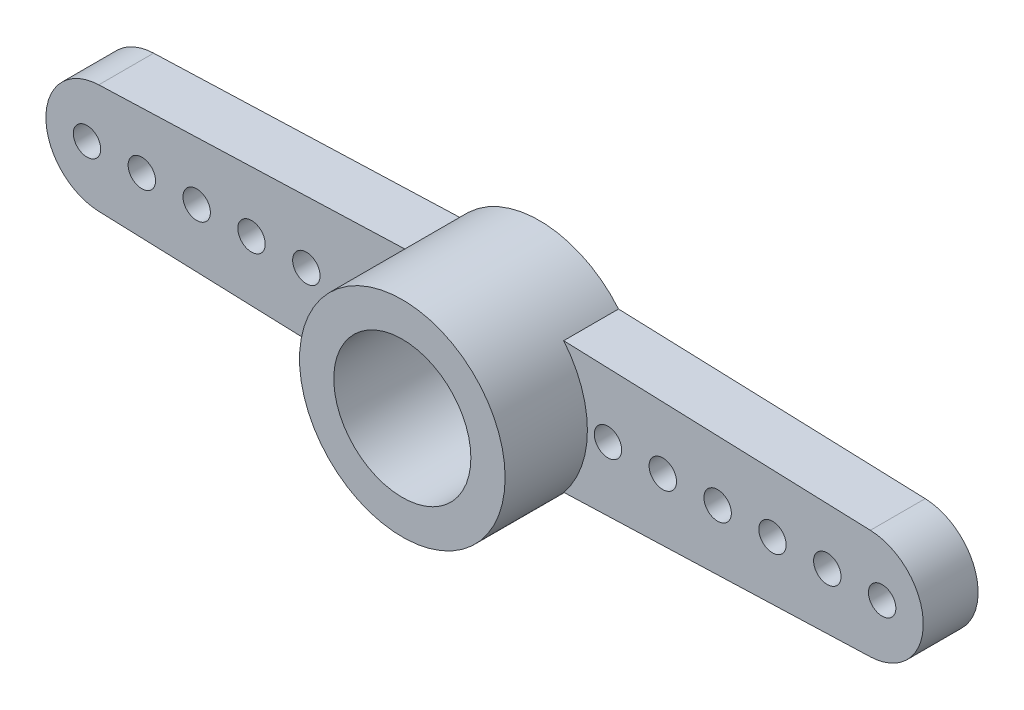
ISO-10303-21;
HEADER;
FILE_DESCRIPTION(('STEP AP214'),'2;1');
FILE_NAME('part.step','',(''),(''),'','','');
FILE_SCHEMA(('AUTOMOTIVE_DESIGN { 1 0 10303 214 1 1 1 1 }'));
ENDSEC;
DATA;
#1=APPLICATION_CONTEXT('core data for automotive mechanical design processes');
#2=APPLICATION_PROTOCOL_DEFINITION('international standard','automotive_design',2000,#1);
#3=PRODUCT_CONTEXT('',#1,'mechanical');
#4=PRODUCT('Part','Part','',(#3));
#5=PRODUCT_RELATED_PRODUCT_CATEGORY('part','',(#4));
#6=PRODUCT_DEFINITION_FORMATION('','',#4);
#7=PRODUCT_DEFINITION_CONTEXT('part definition',#1,'design');
#8=PRODUCT_DEFINITION('design','',#6,#7);
#9=PRODUCT_DEFINITION_SHAPE('','',#8);
#10=(LENGTH_UNIT() NAMED_UNIT(*) SI_UNIT(.MILLI.,.METRE.));
#11=(NAMED_UNIT(*) PLANE_ANGLE_UNIT() SI_UNIT($,.RADIAN.));
#12=(NAMED_UNIT(*) SI_UNIT($,.STERADIAN.) SOLID_ANGLE_UNIT());
#13=UNCERTAINTY_MEASURE_WITH_UNIT(LENGTH_MEASURE(1.E-05),#10,'distance_accuracy_value','');
#14=(GEOMETRIC_REPRESENTATION_CONTEXT(3) GLOBAL_UNCERTAINTY_ASSIGNED_CONTEXT((#13)) GLOBAL_UNIT_ASSIGNED_CONTEXT((#10,
#11,#12)) REPRESENTATION_CONTEXT('',''));
#15=CARTESIAN_POINT('',(0.,0.,0.));
#16=DIRECTION('',(0.,0.,1.));
#17=DIRECTION('',(1.,0.,0.));
#18=AXIS2_PLACEMENT_3D('',#15,#16,#17);
#19=CARTESIAN_POINT('',(0.,0.,0.));
#20=DIRECTION('',(0.,0.,1.));
#21=DIRECTION('',(1.,0.,0.));
#22=AXIS2_PLACEMENT_3D('',#19,#20,#21);
#23=CYLINDRICAL_SURFACE('',#22,2.5);
#24=CARTESIAN_POINT('',(0.,0.,5.));
#25=DIRECTION('',(0.,0.,1.));
#26=DIRECTION('',(1.,0.,0.));
#27=AXIS2_PLACEMENT_3D('',#24,#25,#26);
#28=CIRCLE('',#27,2.5);
#29=CARTESIAN_POINT('',(2.5,0.,5.));
#30=VERTEX_POINT('',#29);
#31=EDGE_CURVE('E538',#30,#30,#28,.T.);
#32=ORIENTED_EDGE('',*,*,#31,.T.);
#33=EDGE_LOOP('',(#32));
#34=FACE_BOUND('',#33,.T.);
#35=CARTESIAN_POINT('',(0.,0.,1.));
#36=DIRECTION('',(0.,0.,-1.));
#37=DIRECTION('',(-1.,0.,0.));
#38=AXIS2_PLACEMENT_3D('',#35,#36,#37);
#39=CIRCLE('',#38,2.5);
#40=CARTESIAN_POINT('',(-2.5,0.,1.));
#41=VERTEX_POINT('',#40);
#42=EDGE_CURVE('E464',#41,#41,#39,.T.);
#43=ORIENTED_EDGE('',*,*,#42,.T.);
#44=EDGE_LOOP('',(#43));
#45=FACE_BOUND('',#44,.T.);
#46=ADVANCED_FACE('F40',(#34,#45),#23,.F.);
#47=CARTESIAN_POINT('',(0.,0.,2.));
#48=DIRECTION('',(0.,0.,1.));
#49=DIRECTION('',(1.,0.,0.));
#50=AXIS2_PLACEMENT_3D('',#47,#48,#49);
#51=PLANE('',#50);
#52=CARTESIAN_POINT('',(-12.5,0.,2.));
#53=DIRECTION('',(0.,0.,-1.));
#54=DIRECTION('',(-1.,0.,0.));
#55=AXIS2_PLACEMENT_3D('',#52,#53,#54);
#56=CIRCLE('',#55,0.500000000000001);
#57=CARTESIAN_POINT('',(-13.,0.,2.));
#58=VERTEX_POINT('',#57);
#59=EDGE_CURVE('E478',#58,#58,#56,.F.);
#60=ORIENTED_EDGE('',*,*,#59,.F.);
#61=EDGE_LOOP('',(#60));
#62=FACE_BOUND('',#61,.T.);
#63=CARTESIAN_POINT('',(-8.5,0.,2.));
#64=DIRECTION('',(0.,0.,-1.));
#65=DIRECTION('',(-1.,0.,0.));
#66=AXIS2_PLACEMENT_3D('',#63,#64,#65);
#67=CIRCLE('',#66,0.500000000000001);
#68=CARTESIAN_POINT('',(-9.,0.,2.));
#69=VERTEX_POINT('',#68);
#70=EDGE_CURVE('E490',#69,#69,#67,.F.);
#71=ORIENTED_EDGE('',*,*,#70,.F.);
#72=EDGE_LOOP('',(#71));
#73=FACE_BOUND('',#72,.T.);
#74=CARTESIAN_POINT('',(-4.5,0.,2.));
#75=DIRECTION('',(0.,0.,-1.));
#76=DIRECTION('',(-1.,0.,0.));
#77=AXIS2_PLACEMENT_3D('',#74,#75,#76);
#78=CIRCLE('',#77,0.500000000000001);
#79=CARTESIAN_POINT('',(-5.,0.,2.));
#80=VERTEX_POINT('',#79);
#81=EDGE_CURVE('E502',#80,#80,#78,.F.);
#82=ORIENTED_EDGE('',*,*,#81,.F.);
#83=EDGE_LOOP('',(#82));
#84=FACE_BOUND('',#83,.T.);
#85=CARTESIAN_POINT('',(0.,0.,2.));
#86=DIRECTION('',(0.,0.,1.));
#87=DIRECTION('',(1.,0.,0.));
#88=AXIS2_PLACEMENT_3D('',#85,#86,#87);
#89=CIRCLE('',#88,3.75);
#90=CARTESIAN_POINT('',(-2.88547071027724,2.39511143376089,2.));
#91=VERTEX_POINT('',#90);
#92=CARTESIAN_POINT('',(-2.88547071027724,-2.39511143376089,2.));
#93=VERTEX_POINT('',#92);
#94=EDGE_CURVE('E12',#91,#93,#89,.T.);
#95=ORIENTED_EDGE('',*,*,#94,.F.);
#96=DIRECTION('',(0.999372730394994,0.0354139201848026,0.));
#97=VECTOR('',#96,1.);
#98=CARTESIAN_POINT('',(-0.0883858807695831,2.49422934631706,2.));
#99=LINE('',#98,#97);
#100=CARTESIAN_POINT('',(-14.0708278403696,1.99874546078999,2.));
#101=VERTEX_POINT('',#100);
#102=EDGE_CURVE('E185',#101,#91,#99,.T.);
#103=ORIENTED_EDGE('',*,*,#102,.F.);
#104=CARTESIAN_POINT('',(-14.,0.,2.));
#105=DIRECTION('',(0.,0.,1.));
#106=DIRECTION('',(1.,0.,0.));
#107=AXIS2_PLACEMENT_3D('',#104,#105,#106);
#108=CIRCLE('',#107,2.);
#109=CARTESIAN_POINT('',(-14.0708278403696,-1.99874546078999,2.));
#110=VERTEX_POINT('',#109);
#111=EDGE_CURVE('E178',#110,#101,#108,.F.);
#112=ORIENTED_EDGE('',*,*,#111,.F.);
#113=DIRECTION('',(0.999372730394994,-0.0354139201848024,0.));
#114=VECTOR('',#113,1.);
#115=CARTESIAN_POINT('',(-0.0883858807695825,-2.49422934631706,2.));
#116=LINE('',#115,#114);
#117=EDGE_CURVE('E182',#110,#93,#116,.T.);
#118=ORIENTED_EDGE('',*,*,#117,.T.);
#119=EDGE_LOOP('',(#95,#103,#112,#118));
#120=FACE_BOUND('',#119,.T.);
#121=CARTESIAN_POINT('',(-6.5,0.,2.));
#122=DIRECTION('',(0.,0.,-1.));
#123=DIRECTION('',(-1.,0.,0.));
#124=AXIS2_PLACEMENT_3D('',#121,#122,#123);
#125=CIRCLE('',#124,0.500000000000001);
#126=CARTESIAN_POINT('',(-7.,0.,2.));
#127=VERTEX_POINT('',#126);
#128=EDGE_CURVE('E496',#127,#127,#125,.F.);
#129=ORIENTED_EDGE('',*,*,#128,.F.);
#130=EDGE_LOOP('',(#129));
#131=FACE_BOUND('',#130,.T.);
#132=CARTESIAN_POINT('',(-10.5,0.,2.));
#133=DIRECTION('',(0.,0.,-1.));
#134=DIRECTION('',(-1.,0.,0.));
#135=AXIS2_PLACEMENT_3D('',#132,#133,#134);
#136=CIRCLE('',#135,0.500000000000001);
#137=CARTESIAN_POINT('',(-11.,0.,2.));
#138=VERTEX_POINT('',#137);
#139=EDGE_CURVE('E484',#138,#138,#136,.F.);
#140=ORIENTED_EDGE('',*,*,#139,.F.);
#141=EDGE_LOOP('',(#140));
#142=FACE_BOUND('',#141,.T.);
#143=CARTESIAN_POINT('',(-14.5,0.,2.));
#144=DIRECTION('',(0.,0.,-1.));
#145=DIRECTION('',(-1.,0.,0.));
#146=AXIS2_PLACEMENT_3D('',#143,#144,#145);
#147=CIRCLE('',#146,0.500000000000001);
#148=CARTESIAN_POINT('',(-15.,0.,2.));
#149=VERTEX_POINT('',#148);
#150=EDGE_CURVE('E472',#149,#149,#147,.F.);
#151=ORIENTED_EDGE('',*,*,#150,.F.);
#152=EDGE_LOOP('',(#151));
#153=FACE_BOUND('',#152,.T.);
#154=ADVANCED_FACE('F186',(#62,#73,#84,#120,#131,#142,#153),#51,.T.);
#155=CARTESIAN_POINT('',(0.,0.,0.));
#156=DIRECTION('',(0.,0.,1.));
#157=DIRECTION('',(1.,0.,0.));
#158=AXIS2_PLACEMENT_3D('',#155,#156,#157);
#159=PLANE('',#158);
#160=CARTESIAN_POINT('',(0.,0.,0.));
#161=DIRECTION('',(0.,0.,-1.));
#162=DIRECTION('',(-1.,0.,0.));
#163=AXIS2_PLACEMENT_3D('',#160,#161,#162);
#164=CIRCLE('',#163,2.5);
#165=CARTESIAN_POINT('',(-2.5,0.,0.));
#166=VERTEX_POINT('',#165);
#167=EDGE_CURVE('E456',#166,#166,#164,.T.);
#168=ORIENTED_EDGE('',*,*,#167,.F.);
#169=EDGE_LOOP('',(#168));
#170=FACE_BOUND('',#169,.T.);
#171=CARTESIAN_POINT('',(12.5,0.,0.));
#172=DIRECTION('',(0.,0.,-1.));
#173=DIRECTION('',(-1.,0.,0.));
#174=AXIS2_PLACEMENT_3D('',#171,#172,#173);
#175=CIRCLE('',#174,0.500000000000001);
#176=CARTESIAN_POINT('',(12.,0.,0.));
#177=VERTEX_POINT('',#176);
#178=EDGE_CURVE('E469',#177,#177,#175,.T.);
#179=ORIENTED_EDGE('',*,*,#178,.F.);
#180=EDGE_LOOP('',(#179));
#181=FACE_BOUND('',#180,.T.);
#182=CARTESIAN_POINT('',(-12.5,0.,0.));
#183=DIRECTION('',(0.,0.,-1.));
#184=DIRECTION('',(-1.,0.,0.));
#185=AXIS2_PLACEMENT_3D('',#182,#183,#184);
#186=CIRCLE('',#185,0.500000000000001);
#187=CARTESIAN_POINT('',(-13.,0.,0.));
#188=VERTEX_POINT('',#187);
#189=EDGE_CURVE('E481',#188,#188,#186,.F.);
#190=ORIENTED_EDGE('',*,*,#189,.T.);
#191=EDGE_LOOP('',(#190));
#192=FACE_BOUND('',#191,.T.);
#193=CARTESIAN_POINT('',(-8.5,0.,0.));
#194=DIRECTION('',(0.,0.,-1.));
#195=DIRECTION('',(-1.,0.,0.));
#196=AXIS2_PLACEMENT_3D('',#193,#194,#195);
#197=CIRCLE('',#196,0.500000000000001);
#198=CARTESIAN_POINT('',(-9.,0.,0.));
#199=VERTEX_POINT('',#198);
#200=EDGE_CURVE('E493',#199,#199,#197,.F.);
#201=ORIENTED_EDGE('',*,*,#200,.T.);
#202=EDGE_LOOP('',(#201));
#203=FACE_BOUND('',#202,.T.);
#204=CARTESIAN_POINT('',(-4.5,0.,0.));
#205=DIRECTION('',(0.,0.,-1.));
#206=DIRECTION('',(-1.,0.,0.));
#207=AXIS2_PLACEMENT_3D('',#204,#205,#206);
#208=CIRCLE('',#207,0.500000000000001);
#209=CARTESIAN_POINT('',(-5.,0.,0.));
#210=VERTEX_POINT('',#209);
#211=EDGE_CURVE('E505',#210,#210,#208,.F.);
#212=ORIENTED_EDGE('',*,*,#211,.T.);
#213=EDGE_LOOP('',(#212));
#214=FACE_BOUND('',#213,.T.);
#215=CARTESIAN_POINT('',(4.5,0.,0.));
#216=DIRECTION('',(0.,0.,-1.));
#217=DIRECTION('',(-1.,0.,0.));
#218=AXIS2_PLACEMENT_3D('',#215,#216,#217);
#219=CIRCLE('',#218,0.500000000000001);
#220=CARTESIAN_POINT('',(4.,0.,0.));
#221=VERTEX_POINT('',#220);
#222=EDGE_CURVE('E511',#221,#221,#219,.T.);
#223=ORIENTED_EDGE('',*,*,#222,.F.);
#224=EDGE_LOOP('',(#223));
#225=FACE_BOUND('',#224,.T.);
#226=CARTESIAN_POINT('',(6.5,0.,0.));
#227=DIRECTION('',(0.,0.,-1.));
#228=DIRECTION('',(-1.,0.,0.));
#229=AXIS2_PLACEMENT_3D('',#226,#227,#228);
#230=CIRCLE('',#229,0.500000000000001);
#231=CARTESIAN_POINT('',(6.,0.,0.));
#232=VERTEX_POINT('',#231);
#233=EDGE_CURVE('E517',#232,#232,#230,.T.);
#234=ORIENTED_EDGE('',*,*,#233,.F.);
#235=EDGE_LOOP('',(#234));
#236=FACE_BOUND('',#235,.T.);
#237=CARTESIAN_POINT('',(8.5,0.,0.));
#238=DIRECTION('',(0.,0.,-1.));
#239=DIRECTION('',(-1.,0.,0.));
#240=AXIS2_PLACEMENT_3D('',#237,#238,#239);
#241=CIRCLE('',#240,0.500000000000001);
#242=CARTESIAN_POINT('',(8.,0.,0.));
#243=VERTEX_POINT('',#242);
#244=EDGE_CURVE('E523',#243,#243,#241,.T.);
#245=ORIENTED_EDGE('',*,*,#244,.F.);
#246=EDGE_LOOP('',(#245));
#247=FACE_BOUND('',#246,.T.);
#248=CARTESIAN_POINT('',(10.5,0.,0.));
#249=DIRECTION('',(0.,0.,-1.));
#250=DIRECTION('',(-1.,0.,0.));
#251=AXIS2_PLACEMENT_3D('',#248,#249,#250);
#252=CIRCLE('',#251,0.500000000000001);
#253=CARTESIAN_POINT('',(10.,0.,0.));
#254=VERTEX_POINT('',#253);
#255=EDGE_CURVE('E529',#254,#254,#252,.T.);
#256=ORIENTED_EDGE('',*,*,#255,.F.);
#257=EDGE_LOOP('',(#256));
#258=FACE_BOUND('',#257,.T.);
#259=CARTESIAN_POINT('',(14.5,0.,0.));
#260=DIRECTION('',(0.,0.,-1.));
#261=DIRECTION('',(-1.,0.,0.));
#262=AXIS2_PLACEMENT_3D('',#259,#260,#261);
#263=CIRCLE('',#262,0.500000000000001);
#264=CARTESIAN_POINT('',(14.,0.,0.));
#265=VERTEX_POINT('',#264);
#266=EDGE_CURVE('E532',#265,#265,#263,.T.);
#267=ORIENTED_EDGE('',*,*,#266,.F.);
#268=EDGE_LOOP('',(#267));
#269=FACE_BOUND('',#268,.T.);
#270=DIRECTION('',(-0.999372730394994,-0.0354139201848029,0.));
#271=VECTOR('',#270,1.);
#272=CARTESIAN_POINT('',(0.0883858807695838,-2.49422934631706,0.));
#273=LINE('',#272,#271);
#274=CARTESIAN_POINT('',(14.0708278403696,-1.99874546078998,0.));
#275=VERTEX_POINT('',#274);
#276=CARTESIAN_POINT('',(2.88547071027724,-2.39511143376089,0.));
#277=VERTEX_POINT('',#276);
#278=EDGE_CURVE('E114',#275,#277,#273,.T.);
#279=ORIENTED_EDGE('',*,*,#278,.T.);
#280=CARTESIAN_POINT('',(0.,0.,0.));
#281=DIRECTION('',(0.,0.,-1.));
#282=DIRECTION('',(-1.,0.,0.));
#283=AXIS2_PLACEMENT_3D('',#280,#281,#282);
#284=CIRCLE('',#283,3.75);
#285=CARTESIAN_POINT('',(-2.88547071027724,-2.39511143376089,0.));
#286=VERTEX_POINT('',#285);
#287=EDGE_CURVE('E91',#277,#286,#284,.T.);
#288=ORIENTED_EDGE('',*,*,#287,.T.);
#289=DIRECTION('',(0.999372730394994,-0.0354139201848024,0.));
#290=VECTOR('',#289,1.);
#291=CARTESIAN_POINT('',(-0.0883858807695825,-2.49422934631706,0.));
#292=LINE('',#291,#290);
#293=CARTESIAN_POINT('',(-14.0708278403696,-1.99874546078999,0.));
#294=VERTEX_POINT('',#293);
#295=EDGE_CURVE('E148',#294,#286,#292,.T.);
#296=ORIENTED_EDGE('',*,*,#295,.F.);
#297=CARTESIAN_POINT('',(-14.,0.,0.));
#298=DIRECTION('',(0.,0.,1.));
#299=DIRECTION('',(1.,0.,0.));
#300=AXIS2_PLACEMENT_3D('',#297,#298,#299);
#301=CIRCLE('',#300,2.);
#302=CARTESIAN_POINT('',(-14.0708278403696,1.99874546078999,0.));
#303=VERTEX_POINT('',#302);
#304=EDGE_CURVE('E180',#294,#303,#301,.F.);
#305=ORIENTED_EDGE('',*,*,#304,.T.);
#306=DIRECTION('',(0.999372730394994,0.0354139201848026,0.));
#307=VECTOR('',#306,1.);
#308=CARTESIAN_POINT('',(-0.0883858807695831,2.49422934631706,0.));
#309=LINE('',#308,#307);
#310=CARTESIAN_POINT('',(-2.88547071027724,2.39511143376089,0.));
#311=VERTEX_POINT('',#310);
#312=EDGE_CURVE('E57',#303,#311,#309,.T.);
#313=ORIENTED_EDGE('',*,*,#312,.T.);
#314=CARTESIAN_POINT('',(2.88547071027724,2.39511143376089,0.));
#315=VERTEX_POINT('',#314);
#316=EDGE_CURVE('E81',#311,#315,#284,.T.);
#317=ORIENTED_EDGE('',*,*,#316,.T.);
#318=DIRECTION('',(-0.999372730394994,0.0354139201848023,0.));
#319=VECTOR('',#318,1.);
#320=CARTESIAN_POINT('',(0.0883858807695825,2.49422934631706,0.));
#321=LINE('',#320,#319);
#322=CARTESIAN_POINT('',(14.0708278403696,1.99874546078999,0.));
#323=VERTEX_POINT('',#322);
#324=EDGE_CURVE('E88',#323,#315,#321,.T.);
#325=ORIENTED_EDGE('',*,*,#324,.F.);
#326=CARTESIAN_POINT('',(14.,0.,0.));
#327=DIRECTION('',(0.,0.,1.));
#328=DIRECTION('',(1.,0.,0.));
#329=AXIS2_PLACEMENT_3D('',#326,#327,#328);
#330=CIRCLE('',#329,2.);
#331=EDGE_CURVE('E110',#275,#323,#330,.T.);
#332=ORIENTED_EDGE('',*,*,#331,.F.);
#333=EDGE_LOOP('',(#279,#288,#296,#305,#313,#317,#325,#332));
#334=FACE_BOUND('',#333,.T.);
#335=CARTESIAN_POINT('',(-6.5,0.,0.));
#336=DIRECTION('',(0.,0.,-1.));
#337=DIRECTION('',(-1.,0.,0.));
#338=AXIS2_PLACEMENT_3D('',#335,#336,#337);
#339=CIRCLE('',#338,0.500000000000001);
#340=CARTESIAN_POINT('',(-7.,0.,0.));
#341=VERTEX_POINT('',#340);
#342=EDGE_CURVE('E499',#341,#341,#339,.F.);
#343=ORIENTED_EDGE('',*,*,#342,.T.);
#344=EDGE_LOOP('',(#343));
#345=FACE_BOUND('',#344,.T.);
#346=CARTESIAN_POINT('',(-10.5,0.,0.));
#347=DIRECTION('',(0.,0.,-1.));
#348=DIRECTION('',(-1.,0.,0.));
#349=AXIS2_PLACEMENT_3D('',#346,#347,#348);
#350=CIRCLE('',#349,0.500000000000001);
#351=CARTESIAN_POINT('',(-11.,0.,0.));
#352=VERTEX_POINT('',#351);
#353=EDGE_CURVE('E487',#352,#352,#350,.F.);
#354=ORIENTED_EDGE('',*,*,#353,.T.);
#355=EDGE_LOOP('',(#354));
#356=FACE_BOUND('',#355,.T.);
#357=CARTESIAN_POINT('',(-14.5,0.,0.));
#358=DIRECTION('',(0.,0.,-1.));
#359=DIRECTION('',(-1.,0.,0.));
#360=AXIS2_PLACEMENT_3D('',#357,#358,#359);
#361=CIRCLE('',#360,0.500000000000001);
#362=CARTESIAN_POINT('',(-15.,0.,0.));
#363=VERTEX_POINT('',#362);
#364=EDGE_CURVE('E475',#363,#363,#361,.F.);
#365=ORIENTED_EDGE('',*,*,#364,.T.);
#366=EDGE_LOOP('',(#365));
#367=FACE_BOUND('',#366,.T.);
#368=ADVANCED_FACE('F84',(#170,#181,#192,#203,#214,#225,#236,#247,#258,#269,#334,#345,#356,
#367),#159,.F.);
#369=CARTESIAN_POINT('',(0.0883858807695838,-2.49422934631706,2.));
#370=DIRECTION('',(0.0354139201848029,-0.999372730394994,0.));
#371=DIRECTION('',(0.999372730394994,0.0354139201848029,0.));
#372=AXIS2_PLACEMENT_3D('',#369,#370,#371);
#373=PLANE('',#372);
#374=ORIENTED_EDGE('',*,*,#278,.F.);
#375=DIRECTION('',(0.,0.,-1.));
#376=VECTOR('',#375,1.);
#377=CARTESIAN_POINT('',(14.0708278403696,-1.99874546078998,2.));
#378=LINE('',#377,#376);
#379=CARTESIAN_POINT('',(14.0708278403696,-1.99874546078998,2.));
#380=VERTEX_POINT('',#379);
#381=EDGE_CURVE('E119',#380,#275,#378,.T.);
#382=ORIENTED_EDGE('',*,*,#381,.F.);
#383=DIRECTION('',(-0.999372730394994,-0.0354139201848029,0.));
#384=VECTOR('',#383,1.);
#385=CARTESIAN_POINT('',(0.0883858807695838,-2.49422934631706,2.));
#386=LINE('',#385,#384);
#387=CARTESIAN_POINT('',(2.88547071027724,-2.39511143376089,2.));
#388=VERTEX_POINT('',#387);
#389=EDGE_CURVE('E109',#380,#388,#386,.T.);
#390=ORIENTED_EDGE('',*,*,#389,.T.);
#391=DIRECTION('',(0.,0.,-1.));
#392=VECTOR('',#391,1.);
#393=CARTESIAN_POINT('',(2.88547071027724,-2.39511143376089,2.));
#394=LINE('',#393,#392);
#395=EDGE_CURVE('E105',#388,#277,#394,.T.);
#396=ORIENTED_EDGE('',*,*,#395,.T.);
#397=EDGE_LOOP('',(#374,#382,#390,#396));
#398=FACE_BOUND('',#397,.T.);
#399=ADVANCED_FACE('F42',(#398),#373,.T.);
#400=CARTESIAN_POINT('',(14.,0.,2.));
#401=DIRECTION('',(0.,0.,-1.));
#402=DIRECTION('',(-1.,0.,0.));
#403=AXIS2_PLACEMENT_3D('',#400,#401,#402);
#404=CYLINDRICAL_SURFACE('',#403,2.);
#405=ORIENTED_EDGE('',*,*,#331,.T.);
#406=DIRECTION('',(0.,0.,-1.));
#407=VECTOR('',#406,1.);
#408=CARTESIAN_POINT('',(14.0708278403696,1.99874546078999,2.));
#409=LINE('',#408,#407);
#410=CARTESIAN_POINT('',(14.0708278403696,1.99874546078999,2.));
#411=VERTEX_POINT('',#410);
#412=EDGE_CURVE('E104',#411,#323,#409,.T.);
#413=ORIENTED_EDGE('',*,*,#412,.F.);
#414=CARTESIAN_POINT('',(14.,0.,2.));
#415=DIRECTION('',(0.,0.,1.));
#416=DIRECTION('',(1.,0.,0.));
#417=AXIS2_PLACEMENT_3D('',#414,#415,#416);
#418=CIRCLE('',#417,2.);
#419=EDGE_CURVE('E66',#380,#411,#418,.T.);
#420=ORIENTED_EDGE('',*,*,#419,.F.);
#421=ORIENTED_EDGE('',*,*,#381,.T.);
#422=EDGE_LOOP('',(#405,#413,#420,#421));
#423=FACE_BOUND('',#422,.T.);
#424=ADVANCED_FACE('F241',(#423),#404,.T.);
#425=CARTESIAN_POINT('',(0.0883858807695825,2.49422934631706,2.));
#426=DIRECTION('',(-0.0354139201848023,-0.999372730394994,0.));
#427=DIRECTION('',(0.999372730394994,-0.0354139201848023,0.));
#428=AXIS2_PLACEMENT_3D('',#425,#426,#427);
#429=PLANE('',#428);
#430=ORIENTED_EDGE('',*,*,#324,.T.);
#431=DIRECTION('',(0.,0.,-1.));
#432=VECTOR('',#431,1.);
#433=CARTESIAN_POINT('',(2.88547071027724,2.39511143376089,2.));
#434=LINE('',#433,#432);
#435=CARTESIAN_POINT('',(2.88547071027724,2.39511143376089,2.));
#436=VERTEX_POINT('',#435);
#437=EDGE_CURVE('E96',#436,#315,#434,.T.);
#438=ORIENTED_EDGE('',*,*,#437,.F.);
#439=DIRECTION('',(-0.999372730394994,0.0354139201848023,0.));
#440=VECTOR('',#439,1.);
#441=CARTESIAN_POINT('',(0.0883858807695825,2.49422934631706,2.));
#442=LINE('',#441,#440);
#443=EDGE_CURVE('E133',#411,#436,#442,.T.);
#444=ORIENTED_EDGE('',*,*,#443,.F.);
#445=ORIENTED_EDGE('',*,*,#412,.T.);
#446=EDGE_LOOP('',(#430,#438,#444,#445));
#447=FACE_BOUND('',#446,.T.);
#448=ADVANCED_FACE('F108',(#447),#429,.F.);
#449=CARTESIAN_POINT('',(12.5,0.,2.));
#450=DIRECTION('',(0.,0.,-1.));
#451=DIRECTION('',(-1.,0.,0.));
#452=AXIS2_PLACEMENT_3D('',#449,#450,#451);
#453=CIRCLE('',#452,0.500000000000001);
#454=CARTESIAN_POINT('',(12.,0.,2.));
#455=VERTEX_POINT('',#454);
#456=EDGE_CURVE('E468',#455,#455,#453,.T.);
#457=ORIENTED_EDGE('',*,*,#456,.T.);
#458=EDGE_LOOP('',(#457));
#459=FACE_BOUND('',#458,.T.);
#460=CARTESIAN_POINT('',(4.5,0.,2.));
#461=DIRECTION('',(0.,0.,-1.));
#462=DIRECTION('',(-1.,0.,0.));
#463=AXIS2_PLACEMENT_3D('',#460,#461,#462);
#464=CIRCLE('',#463,0.500000000000001);
#465=CARTESIAN_POINT('',(4.,0.,2.));
#466=VERTEX_POINT('',#465);
#467=EDGE_CURVE('E508',#466,#466,#464,.T.);
#468=ORIENTED_EDGE('',*,*,#467,.T.);
#469=EDGE_LOOP('',(#468));
#470=FACE_BOUND('',#469,.T.);
#471=CARTESIAN_POINT('',(6.5,0.,2.));
#472=DIRECTION('',(0.,0.,-1.));
#473=DIRECTION('',(-1.,0.,0.));
#474=AXIS2_PLACEMENT_3D('',#471,#472,#473);
#475=CIRCLE('',#474,0.500000000000001);
#476=CARTESIAN_POINT('',(6.,0.,2.));
#477=VERTEX_POINT('',#476);
#478=EDGE_CURVE('E514',#477,#477,#475,.T.);
#479=ORIENTED_EDGE('',*,*,#478,.T.);
#480=EDGE_LOOP('',(#479));
#481=FACE_BOUND('',#480,.T.);
#482=CARTESIAN_POINT('',(8.5,0.,2.));
#483=DIRECTION('',(0.,0.,-1.));
#484=DIRECTION('',(-1.,0.,0.));
#485=AXIS2_PLACEMENT_3D('',#482,#483,#484);
#486=CIRCLE('',#485,0.500000000000001);
#487=CARTESIAN_POINT('',(8.,0.,2.));
#488=VERTEX_POINT('',#487);
#489=EDGE_CURVE('E520',#488,#488,#486,.T.);
#490=ORIENTED_EDGE('',*,*,#489,.T.);
#491=EDGE_LOOP('',(#490));
#492=FACE_BOUND('',#491,.T.);
#493=CARTESIAN_POINT('',(10.5,0.,2.));
#494=DIRECTION('',(0.,0.,-1.));
#495=DIRECTION('',(-1.,0.,0.));
#496=AXIS2_PLACEMENT_3D('',#493,#494,#495);
#497=CIRCLE('',#496,0.500000000000001);
#498=CARTESIAN_POINT('',(10.,0.,2.));
#499=VERTEX_POINT('',#498);
#500=EDGE_CURVE('E526',#499,#499,#497,.T.);
#501=ORIENTED_EDGE('',*,*,#500,.T.);
#502=EDGE_LOOP('',(#501));
#503=FACE_BOUND('',#502,.T.);
#504=CARTESIAN_POINT('',(14.5,0.,2.));
#505=DIRECTION('',(0.,0.,-1.));
#506=DIRECTION('',(-1.,0.,0.));
#507=AXIS2_PLACEMENT_3D('',#504,#505,#506);
#508=CIRCLE('',#507,0.500000000000001);
#509=CARTESIAN_POINT('',(14.,0.,2.));
#510=VERTEX_POINT('',#509);
#511=EDGE_CURVE('E535',#510,#510,#508,.T.);
#512=ORIENTED_EDGE('',*,*,#511,.T.);
#513=EDGE_LOOP('',(#512));
#514=FACE_BOUND('',#513,.T.);
#515=EDGE_CURVE('E49',#388,#436,#89,.T.);
#516=ORIENTED_EDGE('',*,*,#515,.F.);
#517=ORIENTED_EDGE('',*,*,#389,.F.);
#518=ORIENTED_EDGE('',*,*,#419,.T.);
#519=ORIENTED_EDGE('',*,*,#443,.T.);
#520=EDGE_LOOP('',(#516,#517,#518,#519));
#521=FACE_BOUND('',#520,.T.);
#522=ADVANCED_FACE('F228',(#459,#470,#481,#492,#503,#514,#521),#51,.T.);
#523=CARTESIAN_POINT('',(0.,0.,0.));
#524=DIRECTION('',(0.,0.,1.));
#525=DIRECTION('',(1.,0.,0.));
#526=AXIS2_PLACEMENT_3D('',#523,#524,#525);
#527=CYLINDRICAL_SURFACE('',#526,3.75);
#528=ORIENTED_EDGE('',*,*,#316,.F.);
#529=DIRECTION('',(0.,0.,-1.));
#530=VECTOR('',#529,1.);
#531=CARTESIAN_POINT('',(-2.88547071027724,2.39511143376089,2.));
#532=LINE('',#531,#530);
#533=EDGE_CURVE('E198',#91,#311,#532,.T.);
#534=ORIENTED_EDGE('',*,*,#533,.F.);
#535=ORIENTED_EDGE('',*,*,#94,.T.);
#536=DIRECTION('',(0.,0.,-1.));
#537=VECTOR('',#536,1.);
#538=CARTESIAN_POINT('',(-2.88547071027724,-2.39511143376089,2.));
#539=LINE('',#538,#537);
#540=EDGE_CURVE('E154',#93,#286,#539,.T.);
#541=ORIENTED_EDGE('',*,*,#540,.T.);
#542=ORIENTED_EDGE('',*,*,#287,.F.);
#543=ORIENTED_EDGE('',*,*,#395,.F.);
#544=ORIENTED_EDGE('',*,*,#515,.T.);
#545=ORIENTED_EDGE('',*,*,#437,.T.);
#546=EDGE_LOOP('',(#528,#534,#535,#541,#542,#543,#544,#545));
#547=FACE_BOUND('',#546,.T.);
#548=CARTESIAN_POINT('',(0.,0.,5.));
#549=DIRECTION('',(0.,0.,1.));
#550=DIRECTION('',(1.,0.,0.));
#551=AXIS2_PLACEMENT_3D('',#548,#549,#550);
#552=CIRCLE('',#551,3.75);
#553=CARTESIAN_POINT('',(3.75,0.,5.));
#554=VERTEX_POINT('',#553);
#555=EDGE_CURVE('E193',#554,#554,#552,.T.);
#556=ORIENTED_EDGE('',*,*,#555,.F.);
#557=EDGE_LOOP('',(#556));
#558=FACE_BOUND('',#557,.T.);
#559=ADVANCED_FACE('F97',(#547,#558),#527,.T.);
#560=CARTESIAN_POINT('',(-14.,0.,2.));
#561=DIRECTION('',(0.,0.,-1.));
#562=DIRECTION('',(-1.,0.,0.));
#563=AXIS2_PLACEMENT_3D('',#560,#561,#562);
#564=CYLINDRICAL_SURFACE('',#563,2.);
#565=ORIENTED_EDGE('',*,*,#304,.F.);
#566=DIRECTION('',(0.,0.,-1.));
#567=VECTOR('',#566,1.);
#568=CARTESIAN_POINT('',(-14.0708278403696,-1.99874546078999,2.));
#569=LINE('',#568,#567);
#570=EDGE_CURVE('E92',#110,#294,#569,.T.);
#571=ORIENTED_EDGE('',*,*,#570,.F.);
#572=ORIENTED_EDGE('',*,*,#111,.T.);
#573=DIRECTION('',(0.,0.,-1.));
#574=VECTOR('',#573,1.);
#575=CARTESIAN_POINT('',(-14.0708278403696,1.99874546078999,2.));
#576=LINE('',#575,#574);
#577=EDGE_CURVE('E197',#101,#303,#576,.T.);
#578=ORIENTED_EDGE('',*,*,#577,.T.);
#579=EDGE_LOOP('',(#565,#571,#572,#578));
#580=FACE_BOUND('',#579,.T.);
#581=ADVANCED_FACE('F176',(#580),#564,.T.);
#582=CARTESIAN_POINT('',(-0.0883858807695825,-2.49422934631706,2.));
#583=DIRECTION('',(0.0354139201848024,0.999372730394994,0.));
#584=DIRECTION('',(-0.999372730394994,0.0354139201848024,0.));
#585=AXIS2_PLACEMENT_3D('',#582,#583,#584);
#586=PLANE('',#585);
#587=ORIENTED_EDGE('',*,*,#295,.T.);
#588=ORIENTED_EDGE('',*,*,#540,.F.);
#589=ORIENTED_EDGE('',*,*,#117,.F.);
#590=ORIENTED_EDGE('',*,*,#570,.T.);
#591=EDGE_LOOP('',(#587,#588,#589,#590));
#592=FACE_BOUND('',#591,.T.);
#593=ADVANCED_FACE('F183',(#592),#586,.F.);
#594=CARTESIAN_POINT('',(-0.0883858807695831,2.49422934631706,2.));
#595=DIRECTION('',(-0.0354139201848026,0.999372730394994,0.));
#596=DIRECTION('',(-0.999372730394994,-0.0354139201848026,0.));
#597=AXIS2_PLACEMENT_3D('',#594,#595,#596);
#598=PLANE('',#597);
#599=ORIENTED_EDGE('',*,*,#312,.F.);
#600=ORIENTED_EDGE('',*,*,#577,.F.);
#601=ORIENTED_EDGE('',*,*,#102,.T.);
#602=ORIENTED_EDGE('',*,*,#533,.T.);
#603=EDGE_LOOP('',(#599,#600,#601,#602));
#604=FACE_BOUND('',#603,.T.);
#605=ADVANCED_FACE('F208',(#604),#598,.T.);
#606=CARTESIAN_POINT('',(0.,0.,5.));
#607=DIRECTION('',(0.,0.,1.));
#608=DIRECTION('',(1.,0.,0.));
#609=AXIS2_PLACEMENT_3D('',#606,#607,#608);
#610=PLANE('',#609);
#611=ORIENTED_EDGE('',*,*,#555,.T.);
#612=EDGE_LOOP('',(#611));
#613=FACE_BOUND('',#612,.T.);
#614=ORIENTED_EDGE('',*,*,#31,.F.);
#615=EDGE_LOOP('',(#614));
#616=FACE_BOUND('',#615,.T.);
#617=ADVANCED_FACE('F210',(#613,#616),#610,.T.);
#618=CARTESIAN_POINT('',(14.5,0.,2.));
#619=DIRECTION('',(0.,0.,-1.));
#620=DIRECTION('',(-1.,0.,0.));
#621=AXIS2_PLACEMENT_3D('',#618,#619,#620);
#622=CYLINDRICAL_SURFACE('',#621,0.500000000000001);
#623=ORIENTED_EDGE('',*,*,#511,.F.);
#624=EDGE_LOOP('',(#623));
#625=FACE_BOUND('',#624,.T.);
#626=ORIENTED_EDGE('',*,*,#266,.T.);
#627=EDGE_LOOP('',(#626));
#628=FACE_BOUND('',#627,.T.);
#629=ADVANCED_FACE('F216',(#625,#628),#622,.F.);
#630=CARTESIAN_POINT('',(10.5,0.,2.));
#631=DIRECTION('',(0.,0.,-1.));
#632=DIRECTION('',(-1.,0.,0.));
#633=AXIS2_PLACEMENT_3D('',#630,#631,#632);
#634=CYLINDRICAL_SURFACE('',#633,0.500000000000001);
#635=ORIENTED_EDGE('',*,*,#500,.F.);
#636=EDGE_LOOP('',(#635));
#637=FACE_BOUND('',#636,.T.);
#638=ORIENTED_EDGE('',*,*,#255,.T.);
#639=EDGE_LOOP('',(#638));
#640=FACE_BOUND('',#639,.T.);
#641=ADVANCED_FACE('F281',(#637,#640),#634,.F.);
#642=CARTESIAN_POINT('',(8.5,0.,2.));
#643=DIRECTION('',(0.,0.,-1.));
#644=DIRECTION('',(-1.,0.,0.));
#645=AXIS2_PLACEMENT_3D('',#642,#643,#644);
#646=CYLINDRICAL_SURFACE('',#645,0.500000000000001);
#647=ORIENTED_EDGE('',*,*,#489,.F.);
#648=EDGE_LOOP('',(#647));
#649=FACE_BOUND('',#648,.T.);
#650=ORIENTED_EDGE('',*,*,#244,.T.);
#651=EDGE_LOOP('',(#650));
#652=FACE_BOUND('',#651,.T.);
#653=ADVANCED_FACE('F291',(#649,#652),#646,.F.);
#654=CARTESIAN_POINT('',(6.5,0.,2.));
#655=DIRECTION('',(0.,0.,-1.));
#656=DIRECTION('',(-1.,0.,0.));
#657=AXIS2_PLACEMENT_3D('',#654,#655,#656);
#658=CYLINDRICAL_SURFACE('',#657,0.500000000000001);
#659=ORIENTED_EDGE('',*,*,#478,.F.);
#660=EDGE_LOOP('',(#659));
#661=FACE_BOUND('',#660,.T.);
#662=ORIENTED_EDGE('',*,*,#233,.T.);
#663=EDGE_LOOP('',(#662));
#664=FACE_BOUND('',#663,.T.);
#665=ADVANCED_FACE('F301',(#661,#664),#658,.F.);
#666=CARTESIAN_POINT('',(4.5,0.,2.));
#667=DIRECTION('',(0.,0.,-1.));
#668=DIRECTION('',(-1.,0.,0.));
#669=AXIS2_PLACEMENT_3D('',#666,#667,#668);
#670=CYLINDRICAL_SURFACE('',#669,0.500000000000001);
#671=ORIENTED_EDGE('',*,*,#467,.F.);
#672=EDGE_LOOP('',(#671));
#673=FACE_BOUND('',#672,.T.);
#674=ORIENTED_EDGE('',*,*,#222,.T.);
#675=EDGE_LOOP('',(#674));
#676=FACE_BOUND('',#675,.T.);
#677=ADVANCED_FACE('F311',(#673,#676),#670,.F.);
#678=CARTESIAN_POINT('',(-4.5,0.,2.));
#679=DIRECTION('',(0.,0.,-1.));
#680=DIRECTION('',(-1.,0.,0.));
#681=AXIS2_PLACEMENT_3D('',#678,#679,#680);
#682=CYLINDRICAL_SURFACE('',#681,0.500000000000001);
#683=ORIENTED_EDGE('',*,*,#81,.T.);
#684=EDGE_LOOP('',(#683));
#685=FACE_BOUND('',#684,.T.);
#686=ORIENTED_EDGE('',*,*,#211,.F.);
#687=EDGE_LOOP('',(#686));
#688=FACE_BOUND('',#687,.T.);
#689=ADVANCED_FACE('F321',(#685,#688),#682,.F.);
#690=CARTESIAN_POINT('',(-6.5,0.,2.));
#691=DIRECTION('',(0.,0.,-1.));
#692=DIRECTION('',(-1.,0.,0.));
#693=AXIS2_PLACEMENT_3D('',#690,#691,#692);
#694=CYLINDRICAL_SURFACE('',#693,0.500000000000001);
#695=ORIENTED_EDGE('',*,*,#128,.T.);
#696=EDGE_LOOP('',(#695));
#697=FACE_BOUND('',#696,.T.);
#698=ORIENTED_EDGE('',*,*,#342,.F.);
#699=EDGE_LOOP('',(#698));
#700=FACE_BOUND('',#699,.T.);
#701=ADVANCED_FACE('F331',(#697,#700),#694,.F.);
#702=CARTESIAN_POINT('',(-8.5,0.,2.));
#703=DIRECTION('',(0.,0.,-1.));
#704=DIRECTION('',(-1.,0.,0.));
#705=AXIS2_PLACEMENT_3D('',#702,#703,#704);
#706=CYLINDRICAL_SURFACE('',#705,0.500000000000001);
#707=ORIENTED_EDGE('',*,*,#70,.T.);
#708=EDGE_LOOP('',(#707));
#709=FACE_BOUND('',#708,.T.);
#710=ORIENTED_EDGE('',*,*,#200,.F.);
#711=EDGE_LOOP('',(#710));
#712=FACE_BOUND('',#711,.T.);
#713=ADVANCED_FACE('F341',(#709,#712),#706,.F.);
#714=CARTESIAN_POINT('',(-10.5,0.,2.));
#715=DIRECTION('',(0.,0.,-1.));
#716=DIRECTION('',(-1.,0.,0.));
#717=AXIS2_PLACEMENT_3D('',#714,#715,#716);
#718=CYLINDRICAL_SURFACE('',#717,0.500000000000001);
#719=ORIENTED_EDGE('',*,*,#139,.T.);
#720=EDGE_LOOP('',(#719));
#721=FACE_BOUND('',#720,.T.);
#722=ORIENTED_EDGE('',*,*,#353,.F.);
#723=EDGE_LOOP('',(#722));
#724=FACE_BOUND('',#723,.T.);
#725=ADVANCED_FACE('F351',(#721,#724),#718,.F.);
#726=CARTESIAN_POINT('',(-12.5,0.,2.));
#727=DIRECTION('',(0.,0.,-1.));
#728=DIRECTION('',(-1.,0.,0.));
#729=AXIS2_PLACEMENT_3D('',#726,#727,#728);
#730=CYLINDRICAL_SURFACE('',#729,0.500000000000001);
#731=ORIENTED_EDGE('',*,*,#59,.T.);
#732=EDGE_LOOP('',(#731));
#733=FACE_BOUND('',#732,.T.);
#734=ORIENTED_EDGE('',*,*,#189,.F.);
#735=EDGE_LOOP('',(#734));
#736=FACE_BOUND('',#735,.T.);
#737=ADVANCED_FACE('F361',(#733,#736),#730,.F.);
#738=CARTESIAN_POINT('',(-14.5,0.,2.));
#739=DIRECTION('',(0.,0.,-1.));
#740=DIRECTION('',(-1.,0.,0.));
#741=AXIS2_PLACEMENT_3D('',#738,#739,#740);
#742=CYLINDRICAL_SURFACE('',#741,0.500000000000001);
#743=ORIENTED_EDGE('',*,*,#150,.T.);
#744=EDGE_LOOP('',(#743));
#745=FACE_BOUND('',#744,.T.);
#746=ORIENTED_EDGE('',*,*,#364,.F.);
#747=EDGE_LOOP('',(#746));
#748=FACE_BOUND('',#747,.T.);
#749=ADVANCED_FACE('F371',(#745,#748),#742,.F.);
#750=CARTESIAN_POINT('',(12.5,0.,2.));
#751=DIRECTION('',(0.,0.,-1.));
#752=DIRECTION('',(-1.,0.,0.));
#753=AXIS2_PLACEMENT_3D('',#750,#751,#752);
#754=CYLINDRICAL_SURFACE('',#753,0.500000000000001);
#755=ORIENTED_EDGE('',*,*,#456,.F.);
#756=EDGE_LOOP('',(#755));
#757=FACE_BOUND('',#756,.T.);
#758=ORIENTED_EDGE('',*,*,#178,.T.);
#759=EDGE_LOOP('',(#758));
#760=FACE_BOUND('',#759,.T.);
#761=ADVANCED_FACE('F382',(#757,#760),#754,.F.);
#762=CARTESIAN_POINT('',(0.,0.,1.));
#763=DIRECTION('',(0.,0.,-1.));
#764=DIRECTION('',(-1.,0.,0.));
#765=AXIS2_PLACEMENT_3D('',#762,#763,#764);
#766=PLANE('',#765);
#767=CARTESIAN_POINT('',(0.,0.,1.));
#768=DIRECTION('',(0.,0.,-1.));
#769=DIRECTION('',(-1.,0.,0.));
#770=AXIS2_PLACEMENT_3D('',#767,#768,#769);
#771=CIRCLE('',#770,1.25);
#772=CARTESIAN_POINT('',(-1.25,0.,1.));
#773=VERTEX_POINT('',#772);
#774=EDGE_CURVE('E455',#773,#773,#771,.T.);
#775=ORIENTED_EDGE('',*,*,#774,.T.);
#776=EDGE_LOOP('',(#775));
#777=FACE_BOUND('',#776,.T.);
#778=ORIENTED_EDGE('',*,*,#42,.F.);
#779=EDGE_LOOP('',(#778));
#780=FACE_BOUND('',#779,.T.);
#781=ADVANCED_FACE('F391',(#777,#780),#766,.F.);
#782=CARTESIAN_POINT('',(0.,0.,0.5));
#783=DIRECTION('',(0.,0.,-1.));
#784=DIRECTION('',(-1.,0.,0.));
#785=AXIS2_PLACEMENT_3D('',#782,#783,#784);
#786=CYLINDRICAL_SURFACE('',#785,2.5);
#787=CARTESIAN_POINT('',(0.,0.,0.5));
#788=DIRECTION('',(0.,0.,-1.));
#789=DIRECTION('',(-1.,0.,0.));
#790=AXIS2_PLACEMENT_3D('',#787,#788,#789);
#791=CIRCLE('',#790,2.5);
#792=CARTESIAN_POINT('',(-2.5,0.,0.5));
#793=VERTEX_POINT('',#792);
#794=EDGE_CURVE('E459',#793,#793,#791,.T.);
#795=ORIENTED_EDGE('',*,*,#794,.F.);
#796=EDGE_LOOP('',(#795));
#797=FACE_BOUND('',#796,.T.);
#798=ORIENTED_EDGE('',*,*,#167,.T.);
#799=EDGE_LOOP('',(#798));
#800=FACE_BOUND('',#799,.T.);
#801=ADVANCED_FACE('F417',(#797,#800),#786,.F.);
#802=CARTESIAN_POINT('',(0.,0.,0.5));
#803=DIRECTION('',(0.,0.,-1.));
#804=DIRECTION('',(-1.,0.,0.));
#805=AXIS2_PLACEMENT_3D('',#802,#803,#804);
#806=PLANE('',#805);
#807=CARTESIAN_POINT('',(0.,0.,0.5));
#808=DIRECTION('',(0.,0.,-1.));
#809=DIRECTION('',(-1.,0.,0.));
#810=AXIS2_PLACEMENT_3D('',#807,#808,#809);
#811=CIRCLE('',#810,1.25);
#812=CARTESIAN_POINT('',(-1.25,0.,0.5));
#813=VERTEX_POINT('',#812);
#814=EDGE_CURVE('E452',#813,#813,#811,.T.);
#815=ORIENTED_EDGE('',*,*,#814,.F.);
#816=EDGE_LOOP('',(#815));
#817=FACE_BOUND('',#816,.T.);
#818=ORIENTED_EDGE('',*,*,#794,.T.);
#819=EDGE_LOOP('',(#818));
#820=FACE_BOUND('',#819,.T.);
#821=ADVANCED_FACE('F426',(#817,#820),#806,.T.);
#822=CARTESIAN_POINT('',(0.,0.,5.5));
#823=DIRECTION('',(0.,0.,-1.));
#824=DIRECTION('',(-1.,0.,0.));
#825=AXIS2_PLACEMENT_3D('',#822,#823,#824);
#826=CYLINDRICAL_SURFACE('',#825,1.25);
#827=ORIENTED_EDGE('',*,*,#814,.T.);
#828=EDGE_LOOP('',(#827));
#829=FACE_BOUND('',#828,.T.);
#830=ORIENTED_EDGE('',*,*,#774,.F.);
#831=EDGE_LOOP('',(#830));
#832=FACE_BOUND('',#831,.T.);
#833=ADVANCED_FACE('F434',(#829,#832),#826,.F.);
#834=CLOSED_SHELL('',(#46,#154,#368,#399,#424,#448,#522,#559,#581,#593,#605,#617,#629,#641,#653,
#665,#677,#689,#701,#713,#725,#737,#749,#761,#781,#801,#821,#833));
#835=MANIFOLD_SOLID_BREP('B2',#834);
#836=ADVANCED_BREP_SHAPE_REPRESENTATION('',(#18,#835),#14);
#837=SHAPE_DEFINITION_REPRESENTATION(#9,#836);
ENDSEC;
END-ISO-10303-21;
